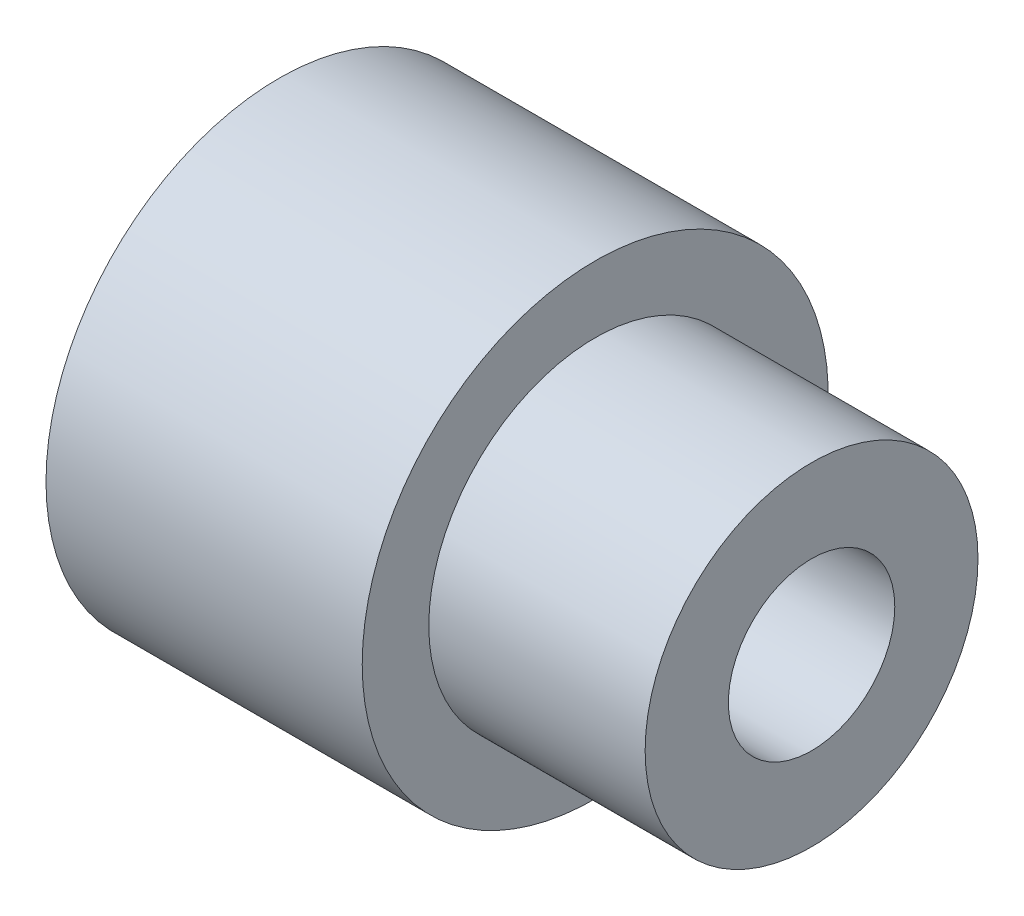
ISO-10303-21;
HEADER;
FILE_DESCRIPTION(('STEP AP214'),'2;1');
FILE_NAME('part.step','',(''),(''),'','','');
FILE_SCHEMA(('AUTOMOTIVE_DESIGN { 1 0 10303 214 1 1 1 1 }'));
ENDSEC;
DATA;
#1=APPLICATION_CONTEXT('core data for automotive mechanical design processes');
#2=APPLICATION_PROTOCOL_DEFINITION('international standard','automotive_design',2000,#1);
#3=PRODUCT_CONTEXT('',#1,'mechanical');
#4=PRODUCT('Part','Part','',(#3));
#5=PRODUCT_RELATED_PRODUCT_CATEGORY('part','',(#4));
#6=PRODUCT_DEFINITION_FORMATION('','',#4);
#7=PRODUCT_DEFINITION_CONTEXT('part definition',#1,'design');
#8=PRODUCT_DEFINITION('design','',#6,#7);
#9=PRODUCT_DEFINITION_SHAPE('','',#8);
#10=(LENGTH_UNIT() NAMED_UNIT(*) SI_UNIT(.MILLI.,.METRE.));
#11=(NAMED_UNIT(*) PLANE_ANGLE_UNIT() SI_UNIT($,.RADIAN.));
#12=(NAMED_UNIT(*) SI_UNIT($,.STERADIAN.) SOLID_ANGLE_UNIT());
#13=UNCERTAINTY_MEASURE_WITH_UNIT(LENGTH_MEASURE(1.E-05),#10,'distance_accuracy_value','');
#14=(GEOMETRIC_REPRESENTATION_CONTEXT(3) GLOBAL_UNCERTAINTY_ASSIGNED_CONTEXT((#13)) GLOBAL_UNIT_ASSIGNED_CONTEXT((#10,
#11,#12)) REPRESENTATION_CONTEXT('',''));
#15=CARTESIAN_POINT('',(0.,0.,0.));
#16=DIRECTION('',(0.,0.,1.));
#17=DIRECTION('',(1.,0.,0.));
#18=AXIS2_PLACEMENT_3D('',#15,#16,#17);
#19=CARTESIAN_POINT('',(13.,0.,0.));
#20=DIRECTION('',(-1.,0.,0.));
#21=DIRECTION('',(0.,0.,1.));
#22=AXIS2_PLACEMENT_3D('',#19,#20,#21);
#23=CYLINDRICAL_SURFACE('',#22,10.);
#24=CARTESIAN_POINT('',(13.,0.,0.));
#25=DIRECTION('',(1.,0.,0.));
#26=DIRECTION('',(0.,0.,-1.));
#27=AXIS2_PLACEMENT_3D('',#24,#25,#26);
#28=CIRCLE('',#27,10.);
#29=CARTESIAN_POINT('',(13.,0.,-10.));
#30=VERTEX_POINT('',#29);
#31=EDGE_CURVE('E50',#30,#30,#28,.T.);
#32=ORIENTED_EDGE('',*,*,#31,.F.);
#33=EDGE_LOOP('',(#32));
#34=FACE_BOUND('',#33,.T.);
#35=CARTESIAN_POINT('',(0.,0.,0.));
#36=DIRECTION('',(1.,0.,0.));
#37=DIRECTION('',(0.,0.,-1.));
#38=AXIS2_PLACEMENT_3D('',#35,#36,#37);
#39=CIRCLE('',#38,10.);
#40=CARTESIAN_POINT('',(0.,0.,-10.));
#41=VERTEX_POINT('',#40);
#42=EDGE_CURVE('E55',#41,#41,#39,.T.);
#43=ORIENTED_EDGE('',*,*,#42,.T.);
#44=EDGE_LOOP('',(#43));
#45=FACE_BOUND('',#44,.T.);
#46=ADVANCED_FACE('F37',(#34,#45),#23,.T.);
#47=CARTESIAN_POINT('',(13.,0.,0.));
#48=DIRECTION('',(1.,0.,0.));
#49=DIRECTION('',(0.,0.,-1.));
#50=AXIS2_PLACEMENT_3D('',#47,#48,#49);
#51=PLANE('',#50);
#52=CARTESIAN_POINT('',(13.,0.,0.));
#53=DIRECTION('',(1.,0.,0.));
#54=DIRECTION('',(0.,0.,-1.));
#55=AXIS2_PLACEMENT_3D('',#52,#53,#54);
#56=CIRCLE('',#55,5.);
#57=CARTESIAN_POINT('',(13.,0.,-5.));
#58=VERTEX_POINT('',#57);
#59=EDGE_CURVE('E63',#58,#58,#56,.T.);
#60=ORIENTED_EDGE('',*,*,#59,.F.);
#61=EDGE_LOOP('',(#60));
#62=FACE_BOUND('',#61,.T.);
#63=ORIENTED_EDGE('',*,*,#31,.T.);
#64=EDGE_LOOP('',(#63));
#65=FACE_BOUND('',#64,.T.);
#66=ADVANCED_FACE('F92',(#62,#65),#51,.T.);
#67=CARTESIAN_POINT('',(-19.,0.,0.));
#68=DIRECTION('',(1.,0.,0.));
#69=DIRECTION('',(0.,0.,-1.));
#70=AXIS2_PLACEMENT_3D('',#67,#68,#69);
#71=CYLINDRICAL_SURFACE('',#70,14.);
#72=CARTESIAN_POINT('',(-19.,0.,0.));
#73=DIRECTION('',(-1.,0.,0.));
#74=DIRECTION('',(0.,0.,1.));
#75=AXIS2_PLACEMENT_3D('',#72,#73,#74);
#76=CIRCLE('',#75,14.);
#77=CARTESIAN_POINT('',(-19.,0.,14.));
#78=VERTEX_POINT('',#77);
#79=EDGE_CURVE('E66',#78,#78,#76,.T.);
#80=ORIENTED_EDGE('',*,*,#79,.F.);
#81=EDGE_LOOP('',(#80));
#82=FACE_BOUND('',#81,.T.);
#83=CARTESIAN_POINT('',(0.,0.,0.));
#84=DIRECTION('',(-1.,0.,0.));
#85=DIRECTION('',(0.,0.,1.));
#86=AXIS2_PLACEMENT_3D('',#83,#84,#85);
#87=CIRCLE('',#86,14.);
#88=CARTESIAN_POINT('',(0.,0.,14.));
#89=VERTEX_POINT('',#88);
#90=EDGE_CURVE('E68',#89,#89,#87,.T.);
#91=ORIENTED_EDGE('',*,*,#90,.T.);
#92=EDGE_LOOP('',(#91));
#93=FACE_BOUND('',#92,.T.);
#94=ADVANCED_FACE('F95',(#82,#93),#71,.T.);
#95=CARTESIAN_POINT('',(-19.,0.,0.));
#96=DIRECTION('',(-1.,0.,0.));
#97=DIRECTION('',(0.,0.,1.));
#98=AXIS2_PLACEMENT_3D('',#95,#96,#97);
#99=PLANE('',#98);
#100=CARTESIAN_POINT('',(-19.,0.,0.));
#101=DIRECTION('',(-1.,0.,0.));
#102=DIRECTION('',(0.,0.,1.));
#103=AXIS2_PLACEMENT_3D('',#100,#101,#102);
#104=CIRCLE('',#103,11.05);
#105=CARTESIAN_POINT('',(-19.,0.,11.05));
#106=VERTEX_POINT('',#105);
#107=EDGE_CURVE('E10',#106,#106,#104,.F.);
#108=ORIENTED_EDGE('',*,*,#107,.T.);
#109=EDGE_LOOP('',(#108));
#110=FACE_BOUND('',#109,.T.);
#111=ORIENTED_EDGE('',*,*,#79,.T.);
#112=EDGE_LOOP('',(#111));
#113=FACE_BOUND('',#112,.T.);
#114=ADVANCED_FACE('F107',(#110,#113),#99,.T.);
#115=CARTESIAN_POINT('',(0.,0.,0.));
#116=DIRECTION('',(-1.,0.,0.));
#117=DIRECTION('',(0.,0.,1.));
#118=AXIS2_PLACEMENT_3D('',#115,#116,#117);
#119=PLANE('',#118);
#120=ORIENTED_EDGE('',*,*,#42,.F.);
#121=EDGE_LOOP('',(#120));
#122=FACE_BOUND('',#121,.T.);
#123=ORIENTED_EDGE('',*,*,#90,.F.);
#124=EDGE_LOOP('',(#123));
#125=FACE_BOUND('',#124,.T.);
#126=ADVANCED_FACE('F103',(#122,#125),#119,.F.);
#127=CARTESIAN_POINT('',(-13.,0.,0.));
#128=DIRECTION('',(-1.,0.,0.));
#129=DIRECTION('',(0.,0.,1.));
#130=AXIS2_PLACEMENT_3D('',#127,#128,#129);
#131=CYLINDRICAL_SURFACE('',#130,11.);
#132=CARTESIAN_POINT('',(-18.95,0.,0.));
#133=DIRECTION('',(-1.,0.,0.));
#134=DIRECTION('',(0.,0.,1.));
#135=AXIS2_PLACEMENT_3D('',#132,#133,#134);
#136=CIRCLE('',#135,11.);
#137=CARTESIAN_POINT('',(-18.95,0.,11.));
#138=VERTEX_POINT('',#137);
#139=EDGE_CURVE('E45',#138,#138,#136,.T.);
#140=ORIENTED_EDGE('',*,*,#139,.T.);
#141=EDGE_LOOP('',(#140));
#142=FACE_BOUND('',#141,.T.);
#143=CARTESIAN_POINT('',(-13.,0.,0.));
#144=DIRECTION('',(-1.,0.,0.));
#145=DIRECTION('',(0.,0.,1.));
#146=AXIS2_PLACEMENT_3D('',#143,#144,#145);
#147=CIRCLE('',#146,11.);
#148=CARTESIAN_POINT('',(-13.,0.,11.));
#149=VERTEX_POINT('',#148);
#150=EDGE_CURVE('E72',#149,#149,#147,.T.);
#151=ORIENTED_EDGE('',*,*,#150,.F.);
#152=EDGE_LOOP('',(#151));
#153=FACE_BOUND('',#152,.T.);
#154=ADVANCED_FACE('F106',(#142,#153),#131,.F.);
#155=CARTESIAN_POINT('',(-13.,0.,0.));
#156=DIRECTION('',(-1.,0.,0.));
#157=DIRECTION('',(0.,0.,1.));
#158=AXIS2_PLACEMENT_3D('',#155,#156,#157);
#159=PLANE('',#158);
#160=CARTESIAN_POINT('',(-13.,0.,0.));
#161=DIRECTION('',(-1.,0.,0.));
#162=DIRECTION('',(0.,0.,1.));
#163=AXIS2_PLACEMENT_3D('',#160,#161,#162);
#164=CIRCLE('',#163,9.);
#165=CARTESIAN_POINT('',(-13.,0.,9.));
#166=VERTEX_POINT('',#165);
#167=EDGE_CURVE('E62',#166,#166,#164,.T.);
#168=ORIENTED_EDGE('',*,*,#167,.F.);
#169=EDGE_LOOP('',(#168));
#170=FACE_BOUND('',#169,.T.);
#171=ORIENTED_EDGE('',*,*,#150,.T.);
#172=EDGE_LOOP('',(#171));
#173=FACE_BOUND('',#172,.T.);
#174=ADVANCED_FACE('F122',(#170,#173),#159,.T.);
#175=CARTESIAN_POINT('',(-3.,0.,0.));
#176=DIRECTION('',(-1.,0.,0.));
#177=DIRECTION('',(0.,0.,1.));
#178=AXIS2_PLACEMENT_3D('',#175,#176,#177);
#179=CYLINDRICAL_SURFACE('',#178,9.);
#180=CARTESIAN_POINT('',(-3.,0.,0.));
#181=DIRECTION('',(-1.,0.,0.));
#182=DIRECTION('',(0.,0.,1.));
#183=AXIS2_PLACEMENT_3D('',#180,#181,#182);
#184=CIRCLE('',#183,9.);
#185=CARTESIAN_POINT('',(-3.,0.,9.));
#186=VERTEX_POINT('',#185);
#187=EDGE_CURVE('E79',#186,#186,#184,.T.);
#188=ORIENTED_EDGE('',*,*,#187,.F.);
#189=EDGE_LOOP('',(#188));
#190=FACE_BOUND('',#189,.T.);
#191=ORIENTED_EDGE('',*,*,#167,.T.);
#192=EDGE_LOOP('',(#191));
#193=FACE_BOUND('',#192,.T.);
#194=ADVANCED_FACE('F125',(#190,#193),#179,.F.);
#195=CARTESIAN_POINT('',(-3.,0.,0.));
#196=DIRECTION('',(-1.,0.,0.));
#197=DIRECTION('',(0.,0.,1.));
#198=AXIS2_PLACEMENT_3D('',#195,#196,#197);
#199=PLANE('',#198);
#200=CARTESIAN_POINT('',(-3.,0.,0.));
#201=DIRECTION('',(-1.,0.,0.));
#202=DIRECTION('',(0.,0.,1.));
#203=AXIS2_PLACEMENT_3D('',#200,#201,#202);
#204=CIRCLE('',#203,5.);
#205=CARTESIAN_POINT('',(-3.,0.,5.));
#206=VERTEX_POINT('',#205);
#207=EDGE_CURVE('E58',#206,#206,#204,.T.);
#208=ORIENTED_EDGE('',*,*,#207,.F.);
#209=EDGE_LOOP('',(#208));
#210=FACE_BOUND('',#209,.T.);
#211=ORIENTED_EDGE('',*,*,#187,.T.);
#212=EDGE_LOOP('',(#211));
#213=FACE_BOUND('',#212,.T.);
#214=ADVANCED_FACE('F129',(#210,#213),#199,.T.);
#215=CARTESIAN_POINT('',(-19.,0.,0.));
#216=DIRECTION('',(1.,0.,0.));
#217=DIRECTION('',(0.,0.,-1.));
#218=AXIS2_PLACEMENT_3D('',#215,#216,#217);
#219=CYLINDRICAL_SURFACE('',#218,5.);
#220=ORIENTED_EDGE('',*,*,#207,.T.);
#221=EDGE_LOOP('',(#220));
#222=FACE_BOUND('',#221,.T.);
#223=ORIENTED_EDGE('',*,*,#59,.T.);
#224=EDGE_LOOP('',(#223));
#225=FACE_BOUND('',#224,.T.);
#226=ADVANCED_FACE('F90',(#222,#225),#219,.F.);
#227=CARTESIAN_POINT('',(-18.95,0.,0.));
#228=DIRECTION('',(-1.,0.,0.));
#229=DIRECTION('',(0.,0.,1.));
#230=AXIS2_PLACEMENT_3D('',#227,#228,#229);
#231=TOROIDAL_SURFACE('',#230,11.05,0.05);
#232=ORIENTED_EDGE('',*,*,#107,.F.);
#233=EDGE_LOOP('',(#232));
#234=FACE_BOUND('',#233,.T.);
#235=ORIENTED_EDGE('',*,*,#139,.F.);
#236=EDGE_LOOP('',(#235));
#237=FACE_BOUND('',#236,.T.);
#238=ADVANCED_FACE('F39',(#234,#237),#231,.T.);
#239=CLOSED_SHELL('',(#46,#66,#94,#114,#126,#154,#174,#194,#214,#226,#238));
#240=MANIFOLD_SOLID_BREP('B2',#239);
#241=ADVANCED_BREP_SHAPE_REPRESENTATION('',(#18,#240),#14);
#242=SHAPE_DEFINITION_REPRESENTATION(#9,#241);
ENDSEC;
END-ISO-10303-21;
